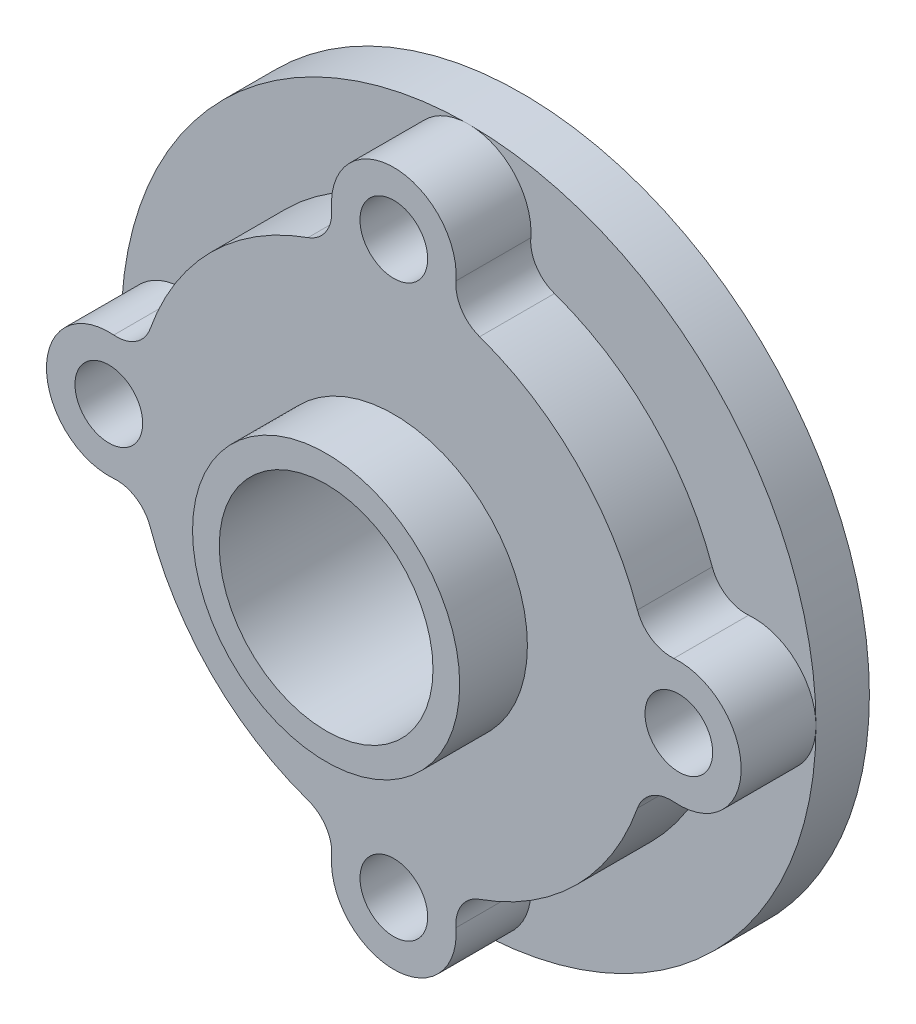
ISO-10303-21;
HEADER;
FILE_DESCRIPTION(('STEP AP214'),'2;1');
FILE_NAME('part.step','',(''),(''),'','','');
FILE_SCHEMA(('AUTOMOTIVE_DESIGN { 1 0 10303 214 1 1 1 1 }'));
ENDSEC;
DATA;
#1=APPLICATION_CONTEXT('core data for automotive mechanical design processes');
#2=APPLICATION_PROTOCOL_DEFINITION('international standard','automotive_design',2000,#1);
#3=PRODUCT_CONTEXT('',#1,'mechanical');
#4=PRODUCT('Part','Part','',(#3));
#5=PRODUCT_RELATED_PRODUCT_CATEGORY('part','',(#4));
#6=PRODUCT_DEFINITION_FORMATION('','',#4);
#7=PRODUCT_DEFINITION_CONTEXT('part definition',#1,'design');
#8=PRODUCT_DEFINITION('design','',#6,#7);
#9=PRODUCT_DEFINITION_SHAPE('','',#8);
#10=(LENGTH_UNIT() NAMED_UNIT(*) SI_UNIT(.MILLI.,.METRE.));
#11=(NAMED_UNIT(*) PLANE_ANGLE_UNIT() SI_UNIT($,.RADIAN.));
#12=(NAMED_UNIT(*) SI_UNIT($,.STERADIAN.) SOLID_ANGLE_UNIT());
#13=UNCERTAINTY_MEASURE_WITH_UNIT(LENGTH_MEASURE(1.E-05),#10,'distance_accuracy_value','');
#14=(GEOMETRIC_REPRESENTATION_CONTEXT(3) GLOBAL_UNCERTAINTY_ASSIGNED_CONTEXT((#13)) GLOBAL_UNIT_ASSIGNED_CONTEXT((#10,
#11,#12)) REPRESENTATION_CONTEXT('',''));
#15=CARTESIAN_POINT('',(0.,0.,0.));
#16=DIRECTION('',(0.,0.,1.));
#17=DIRECTION('',(1.,0.,0.));
#18=AXIS2_PLACEMENT_3D('',#15,#16,#17);
#19=CARTESIAN_POINT('',(0.,0.,15.));
#20=DIRECTION('',(0.,0.,1.));
#21=DIRECTION('',(1.,0.,0.));
#22=AXIS2_PLACEMENT_3D('',#19,#20,#21);
#23=PLANE('',#22);
#24=CARTESIAN_POINT('',(-80.,0.,15.));
#25=DIRECTION('',(0.,0.,1.));
#26=DIRECTION('',(1.,0.,0.));
#27=AXIS2_PLACEMENT_3D('',#24,#25,#26);
#28=CIRCLE('',#27,17.5);
#29=CARTESIAN_POINT('',(-78.6079545454545,17.4445466966752,15.));
#30=VERTEX_POINT('',#29);
#31=CARTESIAN_POINT('',(-97.5,0.,15.));
#32=VERTEX_POINT('',#31);
#33=EDGE_CURVE('E172',#30,#32,#28,.T.);
#34=ORIENTED_EDGE('',*,*,#33,.F.);
#35=CARTESIAN_POINT('',(-77.8125,27.4128590947752,15.));
#36=DIRECTION('',(0.,0.,-1.));
#37=DIRECTION('',(-1.,0.,0.));
#38=AXIS2_PLACEMENT_3D('',#35,#36,#37);
#39=CIRCLE('',#38,10.);
#40=CARTESIAN_POINT('',(-68.3806818181818,24.0900882954085,15.));
#41=VERTEX_POINT('',#40);
#42=EDGE_CURVE('E189',#41,#30,#39,.T.);
#43=ORIENTED_EDGE('',*,*,#42,.F.);
#44=CARTESIAN_POINT('',(0.,0.,15.));
#45=DIRECTION('',(0.,0.,1.));
#46=DIRECTION('',(1.,0.,0.));
#47=AXIS2_PLACEMENT_3D('',#44,#45,#46);
#48=CIRCLE('',#47,72.5);
#49=CARTESIAN_POINT('',(-24.0900882954085,68.3806818181818,15.));
#50=VERTEX_POINT('',#49);
#51=EDGE_CURVE('E509',#50,#41,#48,.T.);
#52=ORIENTED_EDGE('',*,*,#51,.F.);
#53=CARTESIAN_POINT('',(-27.4128590947752,77.8125,15.));
#54=DIRECTION('',(0.,0.,-1.));
#55=DIRECTION('',(1.,0.,0.));
#56=AXIS2_PLACEMENT_3D('',#53,#54,#55);
#57=CIRCLE('',#56,10.);
#58=CARTESIAN_POINT('',(-17.4445466966751,78.6079545454545,15.));
#59=VERTEX_POINT('',#58);
#60=EDGE_CURVE('E198',#59,#50,#57,.T.);
#61=ORIENTED_EDGE('',*,*,#60,.F.);
#62=CARTESIAN_POINT('',(0.,80.,15.));
#63=DIRECTION('',(0.,0.,1.));
#64=DIRECTION('',(1.,0.,0.));
#65=AXIS2_PLACEMENT_3D('',#62,#63,#64);
#66=CIRCLE('',#65,17.5);
#67=CARTESIAN_POINT('',(0.,97.5,15.));
#68=VERTEX_POINT('',#67);
#69=EDGE_CURVE('E204',#68,#59,#66,.T.);
#70=ORIENTED_EDGE('',*,*,#69,.F.);
#71=CARTESIAN_POINT('',(0.,0.,15.));
#72=DIRECTION('',(0.,0.,1.));
#73=DIRECTION('',(1.,0.,0.));
#74=AXIS2_PLACEMENT_3D('',#71,#72,#73);
#75=CIRCLE('',#74,97.5);
#76=EDGE_CURVE('E313',#68,#32,#75,.T.);
#77=ORIENTED_EDGE('',*,*,#76,.T.);
#78=EDGE_LOOP('',(#34,#43,#52,#61,#70,#77));
#79=FACE_BOUND('',#78,.T.);
#80=ADVANCED_FACE('F36',(#79),#23,.T.);
#81=CARTESIAN_POINT('',(-77.8125,-27.4128590947752,15.));
#82=DIRECTION('',(0.,0.,-1.));
#83=DIRECTION('',(1.,0.,0.));
#84=AXIS2_PLACEMENT_3D('',#81,#82,#83);
#85=CIRCLE('',#84,10.);
#86=CARTESIAN_POINT('',(-78.6079545454545,-17.4445466966752,15.));
#87=VERTEX_POINT('',#86);
#88=CARTESIAN_POINT('',(-68.3806818181818,-24.0900882954085,15.));
#89=VERTEX_POINT('',#88);
#90=EDGE_CURVE('E171',#87,#89,#85,.T.);
#91=ORIENTED_EDGE('',*,*,#90,.F.);
#92=EDGE_CURVE('E168',#32,#87,#28,.T.);
#93=ORIENTED_EDGE('',*,*,#92,.F.);
#94=CARTESIAN_POINT('',(0.,-97.5,15.));
#95=VERTEX_POINT('',#94);
#96=EDGE_CURVE('E309',#32,#95,#75,.T.);
#97=ORIENTED_EDGE('',*,*,#96,.T.);
#98=CARTESIAN_POINT('',(0.,-80.,15.));
#99=DIRECTION('',(0.,0.,1.));
#100=DIRECTION('',(1.,0.,0.));
#101=AXIS2_PLACEMENT_3D('',#98,#99,#100);
#102=CIRCLE('',#101,17.5);
#103=CARTESIAN_POINT('',(-17.4445466966751,-78.6079545454545,15.));
#104=VERTEX_POINT('',#103);
#105=EDGE_CURVE('E250',#104,#95,#102,.T.);
#106=ORIENTED_EDGE('',*,*,#105,.F.);
#107=CARTESIAN_POINT('',(-27.4128590947752,-77.8125,15.));
#108=DIRECTION('',(0.,0.,-1.));
#109=DIRECTION('',(-1.,0.,0.));
#110=AXIS2_PLACEMENT_3D('',#107,#108,#109);
#111=CIRCLE('',#110,10.);
#112=CARTESIAN_POINT('',(-24.0900882954085,-68.3806818181818,15.));
#113=VERTEX_POINT('',#112);
#114=EDGE_CURVE('E254',#113,#104,#111,.T.);
#115=ORIENTED_EDGE('',*,*,#114,.F.);
#116=EDGE_CURVE('E305',#89,#113,#48,.T.);
#117=ORIENTED_EDGE('',*,*,#116,.F.);
#118=EDGE_LOOP('',(#91,#93,#97,#106,#115,#117));
#119=FACE_BOUND('',#118,.T.);
#120=ADVANCED_FACE('F353',(#119),#23,.T.);
#121=CARTESIAN_POINT('',(0.,0.,36.));
#122=DIRECTION('',(0.,0.,-1.));
#123=DIRECTION('',(-1.,0.,0.));
#124=AXIS2_PLACEMENT_3D('',#121,#122,#123);
#125=CYLINDRICAL_SURFACE('',#124,72.5);
#126=DIRECTION('',(0.,0.,-1.));
#127=VECTOR('',#126,1.);
#128=CARTESIAN_POINT('',(-68.3806818181818,24.0900882954085,92.2962175256588));
#129=LINE('',#128,#127);
#130=CARTESIAN_POINT('',(-68.3806818181818,24.0900882954085,36.));
#131=VERTEX_POINT('',#130);
#132=EDGE_CURVE('E192',#131,#41,#129,.T.);
#133=ORIENTED_EDGE('',*,*,#132,.F.);
#134=CARTESIAN_POINT('',(0.,0.,36.));
#135=DIRECTION('',(0.,0.,1.));
#136=DIRECTION('',(1.,0.,0.));
#137=AXIS2_PLACEMENT_3D('',#134,#135,#136);
#138=CIRCLE('',#137,72.5);
#139=CARTESIAN_POINT('',(-24.0900882954085,68.3806818181818,36.));
#140=VERTEX_POINT('',#139);
#141=EDGE_CURVE('E513',#140,#131,#138,.T.);
#142=ORIENTED_EDGE('',*,*,#141,.F.);
#143=DIRECTION('',(0.,0.,-1.));
#144=VECTOR('',#143,1.);
#145=CARTESIAN_POINT('',(-24.0900882954085,68.3806818181818,92.2962175256588));
#146=LINE('',#145,#144);
#147=EDGE_CURVE('E200',#140,#50,#146,.T.);
#148=ORIENTED_EDGE('',*,*,#147,.T.);
#149=ORIENTED_EDGE('',*,*,#51,.T.);
#150=EDGE_LOOP('',(#133,#142,#148,#149));
#151=FACE_BOUND('',#150,.T.);
#152=ADVANCED_FACE('F355',(#151),#125,.T.);
#153=CARTESIAN_POINT('',(17.4445466966751,78.6079545454545,15.));
#154=VERTEX_POINT('',#153);
#155=EDGE_CURVE('E202',#154,#68,#66,.T.);
#156=ORIENTED_EDGE('',*,*,#155,.F.);
#157=CARTESIAN_POINT('',(27.4128590947752,77.8125,15.));
#158=DIRECTION('',(0.,0.,-1.));
#159=DIRECTION('',(-1.,0.,0.));
#160=AXIS2_PLACEMENT_3D('',#157,#158,#159);
#161=CIRCLE('',#160,10.);
#162=CARTESIAN_POINT('',(24.0900882954085,68.3806818181818,15.));
#163=VERTEX_POINT('',#162);
#164=EDGE_CURVE('E185',#163,#154,#161,.T.);
#165=ORIENTED_EDGE('',*,*,#164,.F.);
#166=CARTESIAN_POINT('',(68.3806818181818,24.0900882954085,15.));
#167=VERTEX_POINT('',#166);
#168=EDGE_CURVE('E304',#167,#163,#48,.T.);
#169=ORIENTED_EDGE('',*,*,#168,.F.);
#170=CARTESIAN_POINT('',(77.8125,27.4128590947752,15.));
#171=DIRECTION('',(0.,0.,-1.));
#172=DIRECTION('',(-1.,0.,0.));
#173=AXIS2_PLACEMENT_3D('',#170,#171,#172);
#174=CIRCLE('',#173,10.);
#175=CARTESIAN_POINT('',(78.6079545454545,17.4445466966751,15.));
#176=VERTEX_POINT('',#175);
#177=EDGE_CURVE('E220',#176,#167,#174,.T.);
#178=ORIENTED_EDGE('',*,*,#177,.F.);
#179=CARTESIAN_POINT('',(80.,0.,15.));
#180=DIRECTION('',(0.,0.,1.));
#181=DIRECTION('',(1.,0.,0.));
#182=AXIS2_PLACEMENT_3D('',#179,#180,#181);
#183=CIRCLE('',#182,17.5);
#184=CARTESIAN_POINT('',(97.5,0.,15.));
#185=VERTEX_POINT('',#184);
#186=EDGE_CURVE('E226',#185,#176,#183,.T.);
#187=ORIENTED_EDGE('',*,*,#186,.F.);
#188=EDGE_CURVE('E308',#185,#68,#75,.T.);
#189=ORIENTED_EDGE('',*,*,#188,.T.);
#190=EDGE_LOOP('',(#156,#165,#169,#178,#187,#189));
#191=FACE_BOUND('',#190,.T.);
#192=ADVANCED_FACE('F327',(#191),#23,.T.);
#193=DIRECTION('',(0.,0.,-1.));
#194=VECTOR('',#193,1.);
#195=CARTESIAN_POINT('',(24.0900882954085,68.3806818181818,92.2962175256588));
#196=LINE('',#195,#194);
#197=CARTESIAN_POINT('',(24.0900882954085,68.3806818181818,36.));
#198=VERTEX_POINT('',#197);
#199=EDGE_CURVE('E183',#198,#163,#196,.T.);
#200=ORIENTED_EDGE('',*,*,#199,.F.);
#201=CARTESIAN_POINT('',(68.3806818181818,24.0900882954085,36.));
#202=VERTEX_POINT('',#201);
#203=EDGE_CURVE('E301',#202,#198,#138,.T.);
#204=ORIENTED_EDGE('',*,*,#203,.F.);
#205=DIRECTION('',(0.,0.,-1.));
#206=VECTOR('',#205,1.);
#207=CARTESIAN_POINT('',(68.3806818181818,24.0900882954085,92.2962175256588));
#208=LINE('',#207,#206);
#209=EDGE_CURVE('E209',#202,#167,#208,.T.);
#210=ORIENTED_EDGE('',*,*,#209,.T.);
#211=ORIENTED_EDGE('',*,*,#168,.T.);
#212=EDGE_LOOP('',(#200,#204,#210,#211));
#213=FACE_BOUND('',#212,.T.);
#214=ADVANCED_FACE('F363',(#213),#125,.T.);
#215=CARTESIAN_POINT('',(78.6079545454545,-17.4445466966751,15.));
#216=VERTEX_POINT('',#215);
#217=EDGE_CURVE('E224',#216,#185,#183,.T.);
#218=ORIENTED_EDGE('',*,*,#217,.F.);
#219=CARTESIAN_POINT('',(77.8125,-27.4128590947752,15.));
#220=DIRECTION('',(0.,0.,-1.));
#221=DIRECTION('',(-1.,0.,0.));
#222=AXIS2_PLACEMENT_3D('',#219,#220,#221);
#223=CIRCLE('',#222,10.);
#224=CARTESIAN_POINT('',(68.3806818181818,-24.0900882954085,15.));
#225=VERTEX_POINT('',#224);
#226=EDGE_CURVE('E227',#225,#216,#223,.T.);
#227=ORIENTED_EDGE('',*,*,#226,.F.);
#228=CARTESIAN_POINT('',(24.0900882954085,-68.3806818181818,15.));
#229=VERTEX_POINT('',#228);
#230=EDGE_CURVE('E297',#229,#225,#48,.T.);
#231=ORIENTED_EDGE('',*,*,#230,.F.);
#232=CARTESIAN_POINT('',(27.4128590947752,-77.8125,15.));
#233=DIRECTION('',(0.,0.,-1.));
#234=DIRECTION('',(-1.,0.,0.));
#235=AXIS2_PLACEMENT_3D('',#232,#233,#234);
#236=CIRCLE('',#235,10.);
#237=CARTESIAN_POINT('',(17.4445466966751,-78.6079545454545,15.));
#238=VERTEX_POINT('',#237);
#239=EDGE_CURVE('E246',#238,#229,#236,.T.);
#240=ORIENTED_EDGE('',*,*,#239,.F.);
#241=EDGE_CURVE('E253',#95,#238,#102,.T.);
#242=ORIENTED_EDGE('',*,*,#241,.F.);
#243=EDGE_CURVE('E306',#95,#185,#75,.T.);
#244=ORIENTED_EDGE('',*,*,#243,.T.);
#245=EDGE_LOOP('',(#218,#227,#231,#240,#242,#244));
#246=FACE_BOUND('',#245,.T.);
#247=ADVANCED_FACE('F335',(#246),#23,.T.);
#248=DIRECTION('',(0.,0.,-1.));
#249=VECTOR('',#248,1.);
#250=CARTESIAN_POINT('',(68.3806818181818,-24.0900882954085,92.2962175256588));
#251=LINE('',#250,#249);
#252=CARTESIAN_POINT('',(68.3806818181818,-24.0900882954085,36.));
#253=VERTEX_POINT('',#252);
#254=EDGE_CURVE('E231',#253,#225,#251,.T.);
#255=ORIENTED_EDGE('',*,*,#254,.F.);
#256=CARTESIAN_POINT('',(24.0900882954085,-68.3806818181818,36.));
#257=VERTEX_POINT('',#256);
#258=EDGE_CURVE('E298',#257,#253,#138,.T.);
#259=ORIENTED_EDGE('',*,*,#258,.F.);
#260=DIRECTION('',(0.,0.,-1.));
#261=VECTOR('',#260,1.);
#262=CARTESIAN_POINT('',(24.0900882954085,-68.3806818181818,92.2962175256588));
#263=LINE('',#262,#261);
#264=EDGE_CURVE('E248',#257,#229,#263,.T.);
#265=ORIENTED_EDGE('',*,*,#264,.T.);
#266=ORIENTED_EDGE('',*,*,#230,.T.);
#267=EDGE_LOOP('',(#255,#259,#265,#266));
#268=FACE_BOUND('',#267,.T.);
#269=ADVANCED_FACE('F370',(#268),#125,.T.);
#270=CARTESIAN_POINT('',(-68.3806818181818,-24.0900882954085,36.));
#271=VERTEX_POINT('',#270);
#272=CARTESIAN_POINT('',(-24.0900882954085,-68.3806818181818,36.));
#273=VERTEX_POINT('',#272);
#274=EDGE_CURVE('E294',#271,#273,#138,.T.);
#275=ORIENTED_EDGE('',*,*,#274,.F.);
#276=DIRECTION('',(0.,0.,-1.));
#277=VECTOR('',#276,1.);
#278=CARTESIAN_POINT('',(-68.3806818181818,-24.0900882954085,92.2962175256588));
#279=LINE('',#278,#277);
#280=EDGE_CURVE('E176',#271,#89,#279,.T.);
#281=ORIENTED_EDGE('',*,*,#280,.T.);
#282=ORIENTED_EDGE('',*,*,#116,.T.);
#283=DIRECTION('',(0.,0.,-1.));
#284=VECTOR('',#283,1.);
#285=CARTESIAN_POINT('',(-24.0900882954085,-68.3806818181818,92.2962175256588));
#286=LINE('',#285,#284);
#287=EDGE_CURVE('E235',#273,#113,#286,.T.);
#288=ORIENTED_EDGE('',*,*,#287,.F.);
#289=EDGE_LOOP('',(#275,#281,#282,#288));
#290=FACE_BOUND('',#289,.T.);
#291=ADVANCED_FACE('F364',(#290),#125,.T.);
#292=CARTESIAN_POINT('',(0.,0.,-7.));
#293=DIRECTION('',(0.,0.,-1.));
#294=DIRECTION('',(-1.,0.,0.));
#295=AXIS2_PLACEMENT_3D('',#292,#293,#294);
#296=PLANE('',#295);
#297=CARTESIAN_POINT('',(0.,0.,-7.));
#298=DIRECTION('',(0.,0.,-1.));
#299=DIRECTION('',(-1.,0.,0.));
#300=AXIS2_PLACEMENT_3D('',#297,#298,#299);
#301=CIRCLE('',#300,30.);
#302=CARTESIAN_POINT('',(-30.,0.,-7.));
#303=VERTEX_POINT('',#302);
#304=EDGE_CURVE('E40',#303,#303,#301,.F.);
#305=ORIENTED_EDGE('',*,*,#304,.T.);
#306=EDGE_LOOP('',(#305));
#307=FACE_BOUND('',#306,.T.);
#308=CARTESIAN_POINT('',(0.,0.,-7.));
#309=DIRECTION('',(0.,0.,-1.));
#310=DIRECTION('',(-1.,0.,0.));
#311=AXIS2_PLACEMENT_3D('',#308,#309,#310);
#312=CIRCLE('',#311,37.5);
#313=CARTESIAN_POINT('',(-37.5,0.,-7.));
#314=VERTEX_POINT('',#313);
#315=EDGE_CURVE('E260',#314,#314,#312,.T.);
#316=ORIENTED_EDGE('',*,*,#315,.T.);
#317=EDGE_LOOP('',(#316));
#318=FACE_BOUND('',#317,.T.);
#319=ADVANCED_FACE('F379',(#307,#318),#296,.T.);
#320=CARTESIAN_POINT('',(0.,0.,-12.001));
#321=DIRECTION('',(0.,0.,1.));
#322=DIRECTION('',(1.,0.,0.));
#323=AXIS2_PLACEMENT_3D('',#320,#321,#322);
#324=CYLINDRICAL_SURFACE('',#323,30.);
#325=CARTESIAN_POINT('',(0.,0.,55.));
#326=DIRECTION('',(0.,0.,1.));
#327=DIRECTION('',(1.,0.,0.));
#328=AXIS2_PLACEMENT_3D('',#325,#326,#327);
#329=CIRCLE('',#328,30.);
#330=CARTESIAN_POINT('',(30.,0.,55.));
#331=VERTEX_POINT('',#330);
#332=EDGE_CURVE('E285',#331,#331,#329,.T.);
#333=ORIENTED_EDGE('',*,*,#332,.T.);
#334=EDGE_LOOP('',(#333));
#335=FACE_BOUND('',#334,.T.);
#336=ORIENTED_EDGE('',*,*,#304,.F.);
#337=EDGE_LOOP('',(#336));
#338=FACE_BOUND('',#337,.T.);
#339=ADVANCED_FACE('F404',(#335,#338),#324,.F.);
#340=CARTESIAN_POINT('',(0.,0.,15.));
#341=DIRECTION('',(0.,0.,-1.));
#342=DIRECTION('',(-1.,0.,0.));
#343=AXIS2_PLACEMENT_3D('',#340,#341,#342);
#344=CYLINDRICAL_SURFACE('',#343,97.5);
#345=ORIENTED_EDGE('',*,*,#243,.F.);
#346=ORIENTED_EDGE('',*,*,#96,.F.);
#347=ORIENTED_EDGE('',*,*,#76,.F.);
#348=ORIENTED_EDGE('',*,*,#188,.F.);
#349=EDGE_LOOP('',(#345,#346,#347,#348));
#350=FACE_BOUND('',#349,.T.);
#351=CARTESIAN_POINT('',(0.,0.,0.));
#352=DIRECTION('',(0.,0.,1.));
#353=DIRECTION('',(1.,0.,0.));
#354=AXIS2_PLACEMENT_3D('',#351,#352,#353);
#355=CIRCLE('',#354,97.5);
#356=CARTESIAN_POINT('',(97.5,0.,0.));
#357=VERTEX_POINT('',#356);
#358=EDGE_CURVE('E300',#357,#357,#355,.T.);
#359=ORIENTED_EDGE('',*,*,#358,.T.);
#360=EDGE_LOOP('',(#359));
#361=FACE_BOUND('',#360,.T.);
#362=ADVANCED_FACE('F38',(#350,#361),#344,.T.);
#363=CARTESIAN_POINT('',(0.,0.,0.));
#364=DIRECTION('',(0.,0.,1.));
#365=DIRECTION('',(1.,0.,0.));
#366=AXIS2_PLACEMENT_3D('',#363,#364,#365);
#367=PLANE('',#366);
#368=CARTESIAN_POINT('',(0.,80.,0.));
#369=DIRECTION('',(0.,0.,1.));
#370=DIRECTION('',(1.,0.,0.));
#371=AXIS2_PLACEMENT_3D('',#368,#369,#370);
#372=CIRCLE('',#371,9.5);
#373=CARTESIAN_POINT('',(9.5,80.,0.));
#374=VERTEX_POINT('',#373);
#375=EDGE_CURVE('E197',#374,#374,#372,.F.);
#376=ORIENTED_EDGE('',*,*,#375,.F.);
#377=EDGE_LOOP('',(#376));
#378=FACE_BOUND('',#377,.T.);
#379=CARTESIAN_POINT('',(80.,0.,0.));
#380=DIRECTION('',(0.,0.,1.));
#381=DIRECTION('',(1.,0.,0.));
#382=AXIS2_PLACEMENT_3D('',#379,#380,#381);
#383=CIRCLE('',#382,9.49999999999999);
#384=CARTESIAN_POINT('',(89.5,0.,0.));
#385=VERTEX_POINT('',#384);
#386=EDGE_CURVE('E483',#385,#385,#383,.F.);
#387=ORIENTED_EDGE('',*,*,#386,.F.);
#388=EDGE_LOOP('',(#387));
#389=FACE_BOUND('',#388,.T.);
#390=CARTESIAN_POINT('',(0.,-80.,0.));
#391=DIRECTION('',(0.,0.,1.));
#392=DIRECTION('',(1.,0.,0.));
#393=AXIS2_PLACEMENT_3D('',#390,#391,#392);
#394=CIRCLE('',#393,9.5);
#395=CARTESIAN_POINT('',(9.5,-80.,0.));
#396=VERTEX_POINT('',#395);
#397=EDGE_CURVE('E491',#396,#396,#394,.F.);
#398=ORIENTED_EDGE('',*,*,#397,.F.);
#399=EDGE_LOOP('',(#398));
#400=FACE_BOUND('',#399,.T.);
#401=CARTESIAN_POINT('',(-80.,0.,0.));
#402=DIRECTION('',(0.,0.,1.));
#403=DIRECTION('',(1.,0.,0.));
#404=AXIS2_PLACEMENT_3D('',#401,#402,#403);
#405=CIRCLE('',#404,9.49999999999999);
#406=CARTESIAN_POINT('',(-70.5,0.,0.));
#407=VERTEX_POINT('',#406);
#408=EDGE_CURVE('E496',#407,#407,#405,.F.);
#409=ORIENTED_EDGE('',*,*,#408,.F.);
#410=EDGE_LOOP('',(#409));
#411=FACE_BOUND('',#410,.T.);
#412=CARTESIAN_POINT('',(0.,0.,0.));
#413=DIRECTION('',(0.,0.,-1.));
#414=DIRECTION('',(-1.,0.,0.));
#415=AXIS2_PLACEMENT_3D('',#412,#413,#414);
#416=CIRCLE('',#415,67.5);
#417=CARTESIAN_POINT('',(-67.5,0.,0.));
#418=VERTEX_POINT('',#417);
#419=EDGE_CURVE('E45',#418,#418,#416,.T.);
#420=ORIENTED_EDGE('',*,*,#419,.F.);
#421=EDGE_LOOP('',(#420));
#422=FACE_BOUND('',#421,.T.);
#423=ORIENTED_EDGE('',*,*,#358,.F.);
#424=EDGE_LOOP('',(#423));
#425=FACE_BOUND('',#424,.T.);
#426=ADVANCED_FACE('F386',(#378,#389,#400,#411,#422,#425),#367,.F.);
#427=CARTESIAN_POINT('',(0.,0.,36.));
#428=DIRECTION('',(0.,0.,1.));
#429=DIRECTION('',(1.,0.,0.));
#430=AXIS2_PLACEMENT_3D('',#427,#428,#429);
#431=PLANE('',#430);
#432=CARTESIAN_POINT('',(0.,80.,36.));
#433=DIRECTION('',(0.,0.,1.));
#434=DIRECTION('',(1.,0.,0.));
#435=AXIS2_PLACEMENT_3D('',#432,#433,#434);
#436=CIRCLE('',#435,9.5);
#437=CARTESIAN_POINT('',(9.5,80.,36.));
#438=VERTEX_POINT('',#437);
#439=EDGE_CURVE('E482',#438,#438,#436,.T.);
#440=ORIENTED_EDGE('',*,*,#439,.F.);
#441=EDGE_LOOP('',(#440));
#442=FACE_BOUND('',#441,.T.);
#443=CARTESIAN_POINT('',(80.,0.,36.));
#444=DIRECTION('',(0.,0.,1.));
#445=DIRECTION('',(1.,0.,0.));
#446=AXIS2_PLACEMENT_3D('',#443,#444,#445);
#447=CIRCLE('',#446,9.49999999999999);
#448=CARTESIAN_POINT('',(89.5,0.,36.));
#449=VERTEX_POINT('',#448);
#450=EDGE_CURVE('E487',#449,#449,#447,.T.);
#451=ORIENTED_EDGE('',*,*,#450,.F.);
#452=EDGE_LOOP('',(#451));
#453=FACE_BOUND('',#452,.T.);
#454=CARTESIAN_POINT('',(0.,-80.,36.));
#455=DIRECTION('',(0.,0.,1.));
#456=DIRECTION('',(1.,0.,0.));
#457=AXIS2_PLACEMENT_3D('',#454,#455,#456);
#458=CIRCLE('',#457,9.5);
#459=CARTESIAN_POINT('',(9.5,-80.,36.));
#460=VERTEX_POINT('',#459);
#461=EDGE_CURVE('E493',#460,#460,#458,.T.);
#462=ORIENTED_EDGE('',*,*,#461,.F.);
#463=EDGE_LOOP('',(#462));
#464=FACE_BOUND('',#463,.T.);
#465=CARTESIAN_POINT('',(-80.,0.,36.));
#466=DIRECTION('',(0.,0.,1.));
#467=DIRECTION('',(1.,0.,0.));
#468=AXIS2_PLACEMENT_3D('',#465,#466,#467);
#469=CIRCLE('',#468,9.49999999999999);
#470=CARTESIAN_POINT('',(-70.5,0.,36.));
#471=VERTEX_POINT('',#470);
#472=EDGE_CURVE('E499',#471,#471,#469,.T.);
#473=ORIENTED_EDGE('',*,*,#472,.F.);
#474=EDGE_LOOP('',(#473));
#475=FACE_BOUND('',#474,.T.);
#476=CARTESIAN_POINT('',(0.,0.,36.));
#477=DIRECTION('',(0.,0.,1.));
#478=DIRECTION('',(1.,0.,0.));
#479=AXIS2_PLACEMENT_3D('',#476,#477,#478);
#480=CIRCLE('',#479,37.5);
#481=CARTESIAN_POINT('',(37.5,0.,36.));
#482=VERTEX_POINT('',#481);
#483=EDGE_CURVE('E11',#482,#482,#480,.T.);
#484=ORIENTED_EDGE('',*,*,#483,.F.);
#485=EDGE_LOOP('',(#484));
#486=FACE_BOUND('',#485,.T.);
#487=ORIENTED_EDGE('',*,*,#258,.T.);
#488=CARTESIAN_POINT('',(77.8125,-27.4128590947752,36.));
#489=DIRECTION('',(0.,0.,1.));
#490=DIRECTION('',(1.,0.,0.));
#491=AXIS2_PLACEMENT_3D('',#488,#489,#490);
#492=CIRCLE('',#491,10.);
#493=CARTESIAN_POINT('',(78.6079545454545,-17.4445466966751,36.));
#494=VERTEX_POINT('',#493);
#495=EDGE_CURVE('E236',#253,#494,#492,.F.);
#496=ORIENTED_EDGE('',*,*,#495,.T.);
#497=CARTESIAN_POINT('',(80.,0.,36.));
#498=DIRECTION('',(0.,0.,1.));
#499=DIRECTION('',(1.,0.,0.));
#500=AXIS2_PLACEMENT_3D('',#497,#498,#499);
#501=CIRCLE('',#500,17.5);
#502=CARTESIAN_POINT('',(78.6079545454545,17.4445466966751,36.));
#503=VERTEX_POINT('',#502);
#504=EDGE_CURVE('E232',#494,#503,#501,.T.);
#505=ORIENTED_EDGE('',*,*,#504,.T.);
#506=CARTESIAN_POINT('',(77.8125,27.4128590947752,36.));
#507=DIRECTION('',(0.,0.,1.));
#508=DIRECTION('',(1.,0.,0.));
#509=AXIS2_PLACEMENT_3D('',#506,#507,#508);
#510=CIRCLE('',#509,10.);
#511=EDGE_CURVE('E222',#503,#202,#510,.F.);
#512=ORIENTED_EDGE('',*,*,#511,.T.);
#513=ORIENTED_EDGE('',*,*,#203,.T.);
#514=CARTESIAN_POINT('',(27.4128590947752,77.8125,36.));
#515=DIRECTION('',(0.,0.,1.));
#516=DIRECTION('',(1.,0.,0.));
#517=AXIS2_PLACEMENT_3D('',#514,#515,#516);
#518=CIRCLE('',#517,10.);
#519=CARTESIAN_POINT('',(17.4445466966751,78.6079545454545,36.));
#520=VERTEX_POINT('',#519);
#521=EDGE_CURVE('E212',#198,#520,#518,.F.);
#522=ORIENTED_EDGE('',*,*,#521,.T.);
#523=CARTESIAN_POINT('',(0.,80.,36.));
#524=DIRECTION('',(0.,0.,1.));
#525=DIRECTION('',(1.,0.,0.));
#526=AXIS2_PLACEMENT_3D('',#523,#524,#525);
#527=CIRCLE('',#526,17.5);
#528=CARTESIAN_POINT('',(-17.4445466966751,78.6079545454545,36.));
#529=VERTEX_POINT('',#528);
#530=EDGE_CURVE('E210',#520,#529,#527,.T.);
#531=ORIENTED_EDGE('',*,*,#530,.T.);
#532=CARTESIAN_POINT('',(-27.4128590947752,77.8125,36.));
#533=DIRECTION('',(0.,0.,1.));
#534=DIRECTION('',(1.,0.,0.));
#535=AXIS2_PLACEMENT_3D('',#532,#533,#534);
#536=CIRCLE('',#535,10.);
#537=EDGE_CURVE('E60',#529,#140,#536,.F.);
#538=ORIENTED_EDGE('',*,*,#537,.T.);
#539=ORIENTED_EDGE('',*,*,#141,.T.);
#540=CARTESIAN_POINT('',(-77.8125,27.4128590947752,36.));
#541=DIRECTION('',(0.,0.,1.));
#542=DIRECTION('',(1.,0.,0.));
#543=AXIS2_PLACEMENT_3D('',#540,#541,#542);
#544=CIRCLE('',#543,10.);
#545=CARTESIAN_POINT('',(-78.6079545454545,17.4445466966752,36.));
#546=VERTEX_POINT('',#545);
#547=EDGE_CURVE('E178',#131,#546,#544,.F.);
#548=ORIENTED_EDGE('',*,*,#547,.T.);
#549=CARTESIAN_POINT('',(-80.,0.,36.));
#550=DIRECTION('',(0.,0.,1.));
#551=DIRECTION('',(1.,0.,0.));
#552=AXIS2_PLACEMENT_3D('',#549,#550,#551);
#553=CIRCLE('',#552,17.5);
#554=CARTESIAN_POINT('',(-78.6079545454545,-17.4445466966752,36.));
#555=VERTEX_POINT('',#554);
#556=EDGE_CURVE('E165',#546,#555,#553,.T.);
#557=ORIENTED_EDGE('',*,*,#556,.T.);
#558=CARTESIAN_POINT('',(-77.8125,-27.4128590947752,36.));
#559=DIRECTION('',(0.,0.,1.));
#560=DIRECTION('',(1.,0.,0.));
#561=AXIS2_PLACEMENT_3D('',#558,#559,#560);
#562=CIRCLE('',#561,10.);
#563=EDGE_CURVE('E53',#555,#271,#562,.F.);
#564=ORIENTED_EDGE('',*,*,#563,.T.);
#565=ORIENTED_EDGE('',*,*,#274,.T.);
#566=CARTESIAN_POINT('',(-27.4128590947752,-77.8125,36.));
#567=DIRECTION('',(0.,0.,1.));
#568=DIRECTION('',(1.,0.,0.));
#569=AXIS2_PLACEMENT_3D('',#566,#567,#568);
#570=CIRCLE('',#569,10.);
#571=CARTESIAN_POINT('',(-17.4445466966751,-78.6079545454545,36.));
#572=VERTEX_POINT('',#571);
#573=EDGE_CURVE('E264',#273,#572,#570,.F.);
#574=ORIENTED_EDGE('',*,*,#573,.T.);
#575=CARTESIAN_POINT('',(0.,-80.,36.));
#576=DIRECTION('',(0.,0.,1.));
#577=DIRECTION('',(1.,0.,0.));
#578=AXIS2_PLACEMENT_3D('',#575,#576,#577);
#579=CIRCLE('',#578,17.5);
#580=CARTESIAN_POINT('',(17.4445466966751,-78.6079545454545,36.));
#581=VERTEX_POINT('',#580);
#582=EDGE_CURVE('E261',#572,#581,#579,.T.);
#583=ORIENTED_EDGE('',*,*,#582,.T.);
#584=CARTESIAN_POINT('',(27.4128590947752,-77.8125,36.));
#585=DIRECTION('',(0.,0.,1.));
#586=DIRECTION('',(1.,0.,0.));
#587=AXIS2_PLACEMENT_3D('',#584,#585,#586);
#588=CIRCLE('',#587,10.);
#589=EDGE_CURVE('E258',#581,#257,#588,.F.);
#590=ORIENTED_EDGE('',*,*,#589,.T.);
#591=EDGE_LOOP('',(#487,#496,#505,#512,#513,#522,#531,#538,#539,#548,#557,#564,#565,#574,#583,#590));
#592=FACE_BOUND('',#591,.T.);
#593=ADVANCED_FACE('F182',(#442,#453,#464,#475,#486,#592),#431,.T.);
#594=CARTESIAN_POINT('',(0.,0.,-12.));
#595=DIRECTION('',(0.,0.,1.));
#596=DIRECTION('',(1.,0.,0.));
#597=AXIS2_PLACEMENT_3D('',#594,#595,#596);
#598=CYLINDRICAL_SURFACE('',#597,67.5);
#599=CARTESIAN_POINT('',(0.,0.,-12.));
#600=DIRECTION('',(0.,0.,-1.));
#601=DIRECTION('',(-1.,0.,0.));
#602=AXIS2_PLACEMENT_3D('',#599,#600,#601);
#603=CIRCLE('',#602,67.5);
#604=CARTESIAN_POINT('',(-67.5,0.,-12.));
#605=VERTEX_POINT('',#604);
#606=EDGE_CURVE('E290',#605,#605,#603,.T.);
#607=ORIENTED_EDGE('',*,*,#606,.F.);
#608=EDGE_LOOP('',(#607));
#609=FACE_BOUND('',#608,.T.);
#610=ORIENTED_EDGE('',*,*,#419,.T.);
#611=EDGE_LOOP('',(#610));
#612=FACE_BOUND('',#611,.T.);
#613=ADVANCED_FACE('F385',(#609,#612),#598,.T.);
#614=CARTESIAN_POINT('',(0.,0.,-12.));
#615=DIRECTION('',(0.,0.,-1.));
#616=DIRECTION('',(-1.,0.,0.));
#617=AXIS2_PLACEMENT_3D('',#614,#615,#616);
#618=PLANE('',#617);
#619=CARTESIAN_POINT('',(0.,0.,-12.));
#620=DIRECTION('',(0.,0.,-1.));
#621=DIRECTION('',(-1.,0.,0.));
#622=AXIS2_PLACEMENT_3D('',#619,#620,#621);
#623=CIRCLE('',#622,57.5);
#624=CARTESIAN_POINT('',(-57.5,0.,-12.));
#625=VERTEX_POINT('',#624);
#626=EDGE_CURVE('E282',#625,#625,#623,.T.);
#627=ORIENTED_EDGE('',*,*,#626,.F.);
#628=EDGE_LOOP('',(#627));
#629=FACE_BOUND('',#628,.T.);
#630=ORIENTED_EDGE('',*,*,#606,.T.);
#631=EDGE_LOOP('',(#630));
#632=FACE_BOUND('',#631,.T.);
#633=ADVANCED_FACE('F390',(#629,#632),#618,.T.);
#634=CARTESIAN_POINT('',(0.,0.,55.));
#635=DIRECTION('',(0.,0.,-1.));
#636=DIRECTION('',(-1.,0.,0.));
#637=AXIS2_PLACEMENT_3D('',#634,#635,#636);
#638=CYLINDRICAL_SURFACE('',#637,37.5);
#639=CARTESIAN_POINT('',(0.,0.,55.));
#640=DIRECTION('',(0.,0.,1.));
#641=DIRECTION('',(1.,0.,0.));
#642=AXIS2_PLACEMENT_3D('',#639,#640,#641);
#643=CIRCLE('',#642,37.5);
#644=CARTESIAN_POINT('',(37.5,0.,55.));
#645=VERTEX_POINT('',#644);
#646=EDGE_CURVE('E288',#645,#645,#643,.T.);
#647=ORIENTED_EDGE('',*,*,#646,.F.);
#648=EDGE_LOOP('',(#647));
#649=FACE_BOUND('',#648,.T.);
#650=ORIENTED_EDGE('',*,*,#483,.T.);
#651=EDGE_LOOP('',(#650));
#652=FACE_BOUND('',#651,.T.);
#653=ADVANCED_FACE('F394',(#649,#652),#638,.T.);
#654=CARTESIAN_POINT('',(0.,0.,55.));
#655=DIRECTION('',(0.,0.,1.));
#656=DIRECTION('',(1.,0.,0.));
#657=AXIS2_PLACEMENT_3D('',#654,#655,#656);
#658=PLANE('',#657);
#659=ORIENTED_EDGE('',*,*,#332,.F.);
#660=EDGE_LOOP('',(#659));
#661=FACE_BOUND('',#660,.T.);
#662=ORIENTED_EDGE('',*,*,#646,.T.);
#663=EDGE_LOOP('',(#662));
#664=FACE_BOUND('',#663,.T.);
#665=ADVANCED_FACE('F398',(#661,#664),#658,.T.);
#666=CARTESIAN_POINT('',(0.,0.,-7.));
#667=DIRECTION('',(0.,0.,-1.));
#668=DIRECTION('',(-1.,0.,0.));
#669=AXIS2_PLACEMENT_3D('',#666,#667,#668);
#670=CYLINDRICAL_SURFACE('',#669,57.5);
#671=ORIENTED_EDGE('',*,*,#626,.T.);
#672=EDGE_LOOP('',(#671));
#673=FACE_BOUND('',#672,.T.);
#674=CARTESIAN_POINT('',(0.,0.,13.));
#675=DIRECTION('',(0.,0.,-1.));
#676=DIRECTION('',(-1.,0.,0.));
#677=AXIS2_PLACEMENT_3D('',#674,#675,#676);
#678=CIRCLE('',#677,57.5);
#679=CARTESIAN_POINT('',(-57.5,0.,13.));
#680=VERTEX_POINT('',#679);
#681=EDGE_CURVE('E277',#680,#680,#678,.T.);
#682=ORIENTED_EDGE('',*,*,#681,.F.);
#683=EDGE_LOOP('',(#682));
#684=FACE_BOUND('',#683,.T.);
#685=ADVANCED_FACE('F402',(#673,#684),#670,.F.);
#686=CARTESIAN_POINT('',(0.,0.,13.));
#687=DIRECTION('',(0.,0.,-1.));
#688=DIRECTION('',(-1.,0.,0.));
#689=AXIS2_PLACEMENT_3D('',#686,#687,#688);
#690=PLANE('',#689);
#691=CARTESIAN_POINT('',(0.,0.,13.));
#692=DIRECTION('',(0.,0.,-1.));
#693=DIRECTION('',(-1.,0.,0.));
#694=AXIS2_PLACEMENT_3D('',#691,#692,#693);
#695=CIRCLE('',#694,37.5);
#696=CARTESIAN_POINT('',(-37.5,0.,13.));
#697=VERTEX_POINT('',#696);
#698=EDGE_CURVE('E274',#697,#697,#695,.T.);
#699=ORIENTED_EDGE('',*,*,#698,.F.);
#700=EDGE_LOOP('',(#699));
#701=FACE_BOUND('',#700,.T.);
#702=ORIENTED_EDGE('',*,*,#681,.T.);
#703=EDGE_LOOP('',(#702));
#704=FACE_BOUND('',#703,.T.);
#705=ADVANCED_FACE('F410',(#701,#704),#690,.T.);
#706=CARTESIAN_POINT('',(0.,0.,13.));
#707=DIRECTION('',(0.,0.,-1.));
#708=DIRECTION('',(-1.,0.,0.));
#709=AXIS2_PLACEMENT_3D('',#706,#707,#708);
#710=CYLINDRICAL_SURFACE('',#709,37.5);
#711=ORIENTED_EDGE('',*,*,#698,.T.);
#712=EDGE_LOOP('',(#711));
#713=FACE_BOUND('',#712,.T.);
#714=ORIENTED_EDGE('',*,*,#315,.F.);
#715=EDGE_LOOP('',(#714));
#716=FACE_BOUND('',#715,.T.);
#717=ADVANCED_FACE('F417',(#713,#716),#710,.T.);
#718=CARTESIAN_POINT('',(-27.4128590947752,-77.8125,92.2962175256588));
#719=DIRECTION('',(0.,0.,-1.));
#720=DIRECTION('',(-1.,0.,0.));
#721=AXIS2_PLACEMENT_3D('',#718,#719,#720);
#722=CYLINDRICAL_SURFACE('',#721,10.);
#723=ORIENTED_EDGE('',*,*,#573,.F.);
#724=ORIENTED_EDGE('',*,*,#287,.T.);
#725=ORIENTED_EDGE('',*,*,#114,.T.);
#726=DIRECTION('',(0.,0.,-1.));
#727=VECTOR('',#726,1.);
#728=CARTESIAN_POINT('',(-17.4445466966751,-78.6079545454545,92.2962175256588));
#729=LINE('',#728,#727);
#730=EDGE_CURVE('E257',#572,#104,#729,.T.);
#731=ORIENTED_EDGE('',*,*,#730,.F.);
#732=EDGE_LOOP('',(#723,#724,#725,#731));
#733=FACE_BOUND('',#732,.T.);
#734=ADVANCED_FACE('F349',(#733),#722,.F.);
#735=CARTESIAN_POINT('',(0.,-80.,92.2962175256588));
#736=DIRECTION('',(0.,0.,-1.));
#737=DIRECTION('',(-1.,0.,0.));
#738=AXIS2_PLACEMENT_3D('',#735,#736,#737);
#739=CYLINDRICAL_SURFACE('',#738,17.5);
#740=ORIENTED_EDGE('',*,*,#582,.F.);
#741=ORIENTED_EDGE('',*,*,#730,.T.);
#742=ORIENTED_EDGE('',*,*,#105,.T.);
#743=ORIENTED_EDGE('',*,*,#241,.T.);
#744=DIRECTION('',(0.,0.,-1.));
#745=VECTOR('',#744,1.);
#746=CARTESIAN_POINT('',(17.4445466966751,-78.6079545454545,92.2962175256588));
#747=LINE('',#746,#745);
#748=EDGE_CURVE('E249',#581,#238,#747,.T.);
#749=ORIENTED_EDGE('',*,*,#748,.F.);
#750=EDGE_LOOP('',(#740,#741,#742,#743,#749));
#751=FACE_BOUND('',#750,.T.);
#752=ADVANCED_FACE('F341',(#751),#739,.T.);
#753=CARTESIAN_POINT('',(27.4128590947752,-77.8125,92.2962175256588));
#754=DIRECTION('',(0.,0.,-1.));
#755=DIRECTION('',(-1.,0.,0.));
#756=AXIS2_PLACEMENT_3D('',#753,#754,#755);
#757=CYLINDRICAL_SURFACE('',#756,10.);
#758=ORIENTED_EDGE('',*,*,#589,.F.);
#759=ORIENTED_EDGE('',*,*,#748,.T.);
#760=ORIENTED_EDGE('',*,*,#239,.T.);
#761=ORIENTED_EDGE('',*,*,#264,.F.);
#762=EDGE_LOOP('',(#758,#759,#760,#761));
#763=FACE_BOUND('',#762,.T.);
#764=ADVANCED_FACE('F343',(#763),#757,.F.);
#765=CARTESIAN_POINT('',(77.8125,-27.4128590947752,92.2962175256588));
#766=DIRECTION('',(0.,0.,-1.));
#767=DIRECTION('',(-1.,0.,0.));
#768=AXIS2_PLACEMENT_3D('',#765,#766,#767);
#769=CYLINDRICAL_SURFACE('',#768,10.);
#770=ORIENTED_EDGE('',*,*,#495,.F.);
#771=ORIENTED_EDGE('',*,*,#254,.T.);
#772=ORIENTED_EDGE('',*,*,#226,.T.);
#773=DIRECTION('',(0.,0.,-1.));
#774=VECTOR('',#773,1.);
#775=CARTESIAN_POINT('',(78.6079545454545,-17.4445466966751,92.2962175256588));
#776=LINE('',#775,#774);
#777=EDGE_CURVE('E230',#494,#216,#776,.T.);
#778=ORIENTED_EDGE('',*,*,#777,.F.);
#779=EDGE_LOOP('',(#770,#771,#772,#778));
#780=FACE_BOUND('',#779,.T.);
#781=ADVANCED_FACE('F428',(#780),#769,.F.);
#782=CARTESIAN_POINT('',(80.,0.,92.2962175256588));
#783=DIRECTION('',(0.,0.,-1.));
#784=DIRECTION('',(-1.,0.,0.));
#785=AXIS2_PLACEMENT_3D('',#782,#783,#784);
#786=CYLINDRICAL_SURFACE('',#785,17.5);
#787=ORIENTED_EDGE('',*,*,#504,.F.);
#788=ORIENTED_EDGE('',*,*,#777,.T.);
#789=ORIENTED_EDGE('',*,*,#217,.T.);
#790=ORIENTED_EDGE('',*,*,#186,.T.);
#791=DIRECTION('',(0.,0.,-1.));
#792=VECTOR('',#791,1.);
#793=CARTESIAN_POINT('',(78.6079545454545,17.4445466966751,92.2962175256588));
#794=LINE('',#793,#792);
#795=EDGE_CURVE('E223',#503,#176,#794,.T.);
#796=ORIENTED_EDGE('',*,*,#795,.F.);
#797=EDGE_LOOP('',(#787,#788,#789,#790,#796));
#798=FACE_BOUND('',#797,.T.);
#799=ADVANCED_FACE('F431',(#798),#786,.T.);
#800=CARTESIAN_POINT('',(77.8125,27.4128590947752,92.2962175256588));
#801=DIRECTION('',(0.,0.,-1.));
#802=DIRECTION('',(-1.,0.,0.));
#803=AXIS2_PLACEMENT_3D('',#800,#801,#802);
#804=CYLINDRICAL_SURFACE('',#803,10.);
#805=ORIENTED_EDGE('',*,*,#511,.F.);
#806=ORIENTED_EDGE('',*,*,#795,.T.);
#807=ORIENTED_EDGE('',*,*,#177,.T.);
#808=ORIENTED_EDGE('',*,*,#209,.F.);
#809=EDGE_LOOP('',(#805,#806,#807,#808));
#810=FACE_BOUND('',#809,.T.);
#811=ADVANCED_FACE('F435',(#810),#804,.F.);
#812=CARTESIAN_POINT('',(27.4128590947752,77.8125,92.2962175256588));
#813=DIRECTION('',(0.,0.,-1.));
#814=DIRECTION('',(-1.,0.,0.));
#815=AXIS2_PLACEMENT_3D('',#812,#813,#814);
#816=CYLINDRICAL_SURFACE('',#815,10.);
#817=ORIENTED_EDGE('',*,*,#521,.F.);
#818=ORIENTED_EDGE('',*,*,#199,.T.);
#819=ORIENTED_EDGE('',*,*,#164,.T.);
#820=DIRECTION('',(0.,0.,-1.));
#821=VECTOR('',#820,1.);
#822=CARTESIAN_POINT('',(17.4445466966751,78.6079545454545,92.2962175256588));
#823=LINE('',#822,#821);
#824=EDGE_CURVE('E207',#520,#154,#823,.T.);
#825=ORIENTED_EDGE('',*,*,#824,.F.);
#826=EDGE_LOOP('',(#817,#818,#819,#825));
#827=FACE_BOUND('',#826,.T.);
#828=ADVANCED_FACE('F439',(#827),#816,.F.);
#829=CARTESIAN_POINT('',(0.,80.,92.2962175256588));
#830=DIRECTION('',(0.,0.,-1.));
#831=DIRECTION('',(-1.,0.,0.));
#832=AXIS2_PLACEMENT_3D('',#829,#830,#831);
#833=CYLINDRICAL_SURFACE('',#832,17.5);
#834=ORIENTED_EDGE('',*,*,#530,.F.);
#835=ORIENTED_EDGE('',*,*,#824,.T.);
#836=ORIENTED_EDGE('',*,*,#155,.T.);
#837=ORIENTED_EDGE('',*,*,#69,.T.);
#838=DIRECTION('',(0.,0.,-1.));
#839=VECTOR('',#838,1.);
#840=CARTESIAN_POINT('',(-17.4445466966751,78.6079545454545,92.2962175256588));
#841=LINE('',#840,#839);
#842=EDGE_CURVE('E201',#529,#59,#841,.T.);
#843=ORIENTED_EDGE('',*,*,#842,.F.);
#844=EDGE_LOOP('',(#834,#835,#836,#837,#843));
#845=FACE_BOUND('',#844,.T.);
#846=ADVANCED_FACE('F443',(#845),#833,.T.);
#847=CARTESIAN_POINT('',(-27.4128590947752,77.8125,92.2962175256588));
#848=DIRECTION('',(0.,0.,-1.));
#849=DIRECTION('',(-1.,0.,0.));
#850=AXIS2_PLACEMENT_3D('',#847,#848,#849);
#851=CYLINDRICAL_SURFACE('',#850,10.);
#852=ORIENTED_EDGE('',*,*,#537,.F.);
#853=ORIENTED_EDGE('',*,*,#842,.T.);
#854=ORIENTED_EDGE('',*,*,#60,.T.);
#855=ORIENTED_EDGE('',*,*,#147,.F.);
#856=EDGE_LOOP('',(#852,#853,#854,#855));
#857=FACE_BOUND('',#856,.T.);
#858=ADVANCED_FACE('F447',(#857),#851,.F.);
#859=CARTESIAN_POINT('',(-77.8125,27.4128590947752,92.2962175256588));
#860=DIRECTION('',(0.,0.,-1.));
#861=DIRECTION('',(-1.,0.,0.));
#862=AXIS2_PLACEMENT_3D('',#859,#860,#861);
#863=CYLINDRICAL_SURFACE('',#862,10.);
#864=ORIENTED_EDGE('',*,*,#547,.F.);
#865=ORIENTED_EDGE('',*,*,#132,.T.);
#866=ORIENTED_EDGE('',*,*,#42,.T.);
#867=DIRECTION('',(0.,0.,-1.));
#868=VECTOR('',#867,1.);
#869=CARTESIAN_POINT('',(-78.6079545454545,17.4445466966752,92.2962175256588));
#870=LINE('',#869,#868);
#871=EDGE_CURVE('E194',#546,#30,#870,.T.);
#872=ORIENTED_EDGE('',*,*,#871,.F.);
#873=EDGE_LOOP('',(#864,#865,#866,#872));
#874=FACE_BOUND('',#873,.T.);
#875=ADVANCED_FACE('F451',(#874),#863,.F.);
#876=CARTESIAN_POINT('',(-80.,0.,92.2962175256588));
#877=DIRECTION('',(0.,0.,-1.));
#878=DIRECTION('',(-1.,0.,0.));
#879=AXIS2_PLACEMENT_3D('',#876,#877,#878);
#880=CYLINDRICAL_SURFACE('',#879,17.5);
#881=ORIENTED_EDGE('',*,*,#556,.F.);
#882=ORIENTED_EDGE('',*,*,#871,.T.);
#883=ORIENTED_EDGE('',*,*,#33,.T.);
#884=ORIENTED_EDGE('',*,*,#92,.T.);
#885=DIRECTION('',(0.,0.,-1.));
#886=VECTOR('',#885,1.);
#887=CARTESIAN_POINT('',(-78.6079545454545,-17.4445466966752,92.2962175256588));
#888=LINE('',#887,#886);
#889=EDGE_CURVE('E163',#555,#87,#888,.T.);
#890=ORIENTED_EDGE('',*,*,#889,.F.);
#891=EDGE_LOOP('',(#881,#882,#883,#884,#890));
#892=FACE_BOUND('',#891,.T.);
#893=ADVANCED_FACE('F164',(#892),#880,.T.);
#894=CARTESIAN_POINT('',(-77.8125,-27.4128590947752,92.2962175256588));
#895=DIRECTION('',(0.,0.,-1.));
#896=DIRECTION('',(-1.,0.,0.));
#897=AXIS2_PLACEMENT_3D('',#894,#895,#896);
#898=CYLINDRICAL_SURFACE('',#897,10.);
#899=ORIENTED_EDGE('',*,*,#563,.F.);
#900=ORIENTED_EDGE('',*,*,#889,.T.);
#901=ORIENTED_EDGE('',*,*,#90,.T.);
#902=ORIENTED_EDGE('',*,*,#280,.F.);
#903=EDGE_LOOP('',(#899,#900,#901,#902));
#904=FACE_BOUND('',#903,.T.);
#905=ADVANCED_FACE('F174',(#904),#898,.F.);
#906=CARTESIAN_POINT('',(-80.,0.,-26.8700576850888));
#907=DIRECTION('',(0.,0.,1.));
#908=DIRECTION('',(1.,0.,0.));
#909=AXIS2_PLACEMENT_3D('',#906,#907,#908);
#910=CYLINDRICAL_SURFACE('',#909,9.49999999999999);
#911=ORIENTED_EDGE('',*,*,#408,.T.);
#912=EDGE_LOOP('',(#911));
#913=FACE_BOUND('',#912,.T.);
#914=ORIENTED_EDGE('',*,*,#472,.T.);
#915=EDGE_LOOP('',(#914));
#916=FACE_BOUND('',#915,.T.);
#917=ADVANCED_FACE('F460',(#913,#916),#910,.F.);
#918=CARTESIAN_POINT('',(0.,-80.,-26.8700576850888));
#919=DIRECTION('',(0.,0.,1.));
#920=DIRECTION('',(1.,0.,0.));
#921=AXIS2_PLACEMENT_3D('',#918,#919,#920);
#922=CYLINDRICAL_SURFACE('',#921,9.5);
#923=ORIENTED_EDGE('',*,*,#397,.T.);
#924=EDGE_LOOP('',(#923));
#925=FACE_BOUND('',#924,.T.);
#926=ORIENTED_EDGE('',*,*,#461,.T.);
#927=EDGE_LOOP('',(#926));
#928=FACE_BOUND('',#927,.T.);
#929=ADVANCED_FACE('F463',(#925,#928),#922,.F.);
#930=CARTESIAN_POINT('',(80.,0.,-26.8700576850888));
#931=DIRECTION('',(0.,0.,1.));
#932=DIRECTION('',(1.,0.,0.));
#933=AXIS2_PLACEMENT_3D('',#930,#931,#932);
#934=CYLINDRICAL_SURFACE('',#933,9.49999999999999);
#935=ORIENTED_EDGE('',*,*,#386,.T.);
#936=EDGE_LOOP('',(#935));
#937=FACE_BOUND('',#936,.T.);
#938=ORIENTED_EDGE('',*,*,#450,.T.);
#939=EDGE_LOOP('',(#938));
#940=FACE_BOUND('',#939,.T.);
#941=ADVANCED_FACE('F467',(#937,#940),#934,.F.);
#942=CARTESIAN_POINT('',(0.,80.,-26.8700576850888));
#943=DIRECTION('',(0.,0.,1.));
#944=DIRECTION('',(1.,0.,0.));
#945=AXIS2_PLACEMENT_3D('',#942,#943,#944);
#946=CYLINDRICAL_SURFACE('',#945,9.5);
#947=ORIENTED_EDGE('',*,*,#375,.T.);
#948=EDGE_LOOP('',(#947));
#949=FACE_BOUND('',#948,.T.);
#950=ORIENTED_EDGE('',*,*,#439,.T.);
#951=EDGE_LOOP('',(#950));
#952=FACE_BOUND('',#951,.T.);
#953=ADVANCED_FACE('F471',(#949,#952),#946,.F.);
#954=CLOSED_SHELL('',(#80,#120,#152,#192,#214,#247,#269,#291,#319,#339,#362,#426,#593,#613,#633,
#653,#665,#685,#705,#717,#734,#752,#764,#781,#799,#811,#828,#846,#858,#875,#893,#905,#917,#929,
#941,#953));
#955=MANIFOLD_SOLID_BREP('B2',#954);
#956=ADVANCED_BREP_SHAPE_REPRESENTATION('',(#18,#955),#14);
#957=SHAPE_DEFINITION_REPRESENTATION(#9,#956);
ENDSEC;
END-ISO-10303-21;
